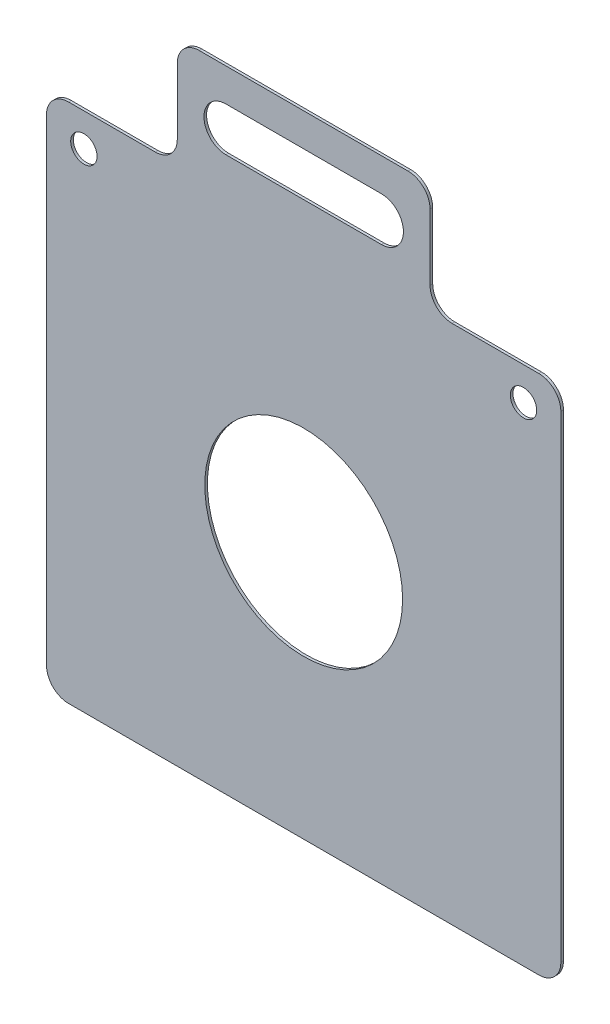
ISO-10303-21;
HEADER;
FILE_DESCRIPTION(('STEP AP214'),'2;1');
FILE_NAME('part.step','',(''),(''),'','','');
FILE_SCHEMA(('AUTOMOTIVE_DESIGN { 1 0 10303 214 1 1 1 1 }'));
ENDSEC;
DATA;
#1=APPLICATION_CONTEXT('core data for automotive mechanical design processes');
#2=APPLICATION_PROTOCOL_DEFINITION('international standard','automotive_design',2000,#1);
#3=PRODUCT_CONTEXT('',#1,'mechanical');
#4=PRODUCT('Part','Part','',(#3));
#5=PRODUCT_RELATED_PRODUCT_CATEGORY('part','',(#4));
#6=PRODUCT_DEFINITION_FORMATION('','',#4);
#7=PRODUCT_DEFINITION_CONTEXT('part definition',#1,'design');
#8=PRODUCT_DEFINITION('design','',#6,#7);
#9=PRODUCT_DEFINITION_SHAPE('','',#8);
#10=(LENGTH_UNIT() NAMED_UNIT(*) SI_UNIT(.MILLI.,.METRE.));
#11=(NAMED_UNIT(*) PLANE_ANGLE_UNIT() SI_UNIT($,.RADIAN.));
#12=(NAMED_UNIT(*) SI_UNIT($,.STERADIAN.) SOLID_ANGLE_UNIT());
#13=UNCERTAINTY_MEASURE_WITH_UNIT(LENGTH_MEASURE(1.E-05),#10,'distance_accuracy_value','');
#14=(GEOMETRIC_REPRESENTATION_CONTEXT(3) GLOBAL_UNCERTAINTY_ASSIGNED_CONTEXT((#13)) GLOBAL_UNIT_ASSIGNED_CONTEXT((#10,
#11,#12)) REPRESENTATION_CONTEXT('',''));
#15=CARTESIAN_POINT('',(0.,0.,0.));
#16=DIRECTION('',(0.,0.,1.));
#17=DIRECTION('',(1.,0.,0.));
#18=AXIS2_PLACEMENT_3D('',#15,#16,#17);
#19=CARTESIAN_POINT('',(-117.,120.,1.2));
#20=DIRECTION('',(0.,-1.,0.));
#21=DIRECTION('',(1.,0.,0.));
#22=AXIS2_PLACEMENT_3D('',#19,#20,#21);
#23=PLANE('',#22);
#24=DIRECTION('',(-1.,0.,0.));
#25=VECTOR('',#24,1.);
#26=CARTESIAN_POINT('',(-117.,120.,1.2));
#27=LINE('',#26,#25);
#28=CARTESIAN_POINT('',(-67.5,120.,1.2));
#29=VERTEX_POINT('',#28);
#30=CARTESIAN_POINT('',(-107.,120.,1.2));
#31=VERTEX_POINT('',#30);
#32=EDGE_CURVE('E248',#29,#31,#27,.T.);
#33=ORIENTED_EDGE('',*,*,#32,.F.);
#34=DIRECTION('',(0.,0.,1.));
#35=VECTOR('',#34,1.);
#36=CARTESIAN_POINT('',(-67.5,120.,1.2));
#37=LINE('',#36,#35);
#38=CARTESIAN_POINT('',(-67.5,120.,0.));
#39=VERTEX_POINT('',#38);
#40=EDGE_CURVE('E307',#29,#39,#37,.F.);
#41=ORIENTED_EDGE('',*,*,#40,.T.);
#42=DIRECTION('',(-1.,0.,0.));
#43=VECTOR('',#42,1.);
#44=CARTESIAN_POINT('',(-117.,120.,0.));
#45=LINE('',#44,#43);
#46=CARTESIAN_POINT('',(-107.,120.,0.));
#47=VERTEX_POINT('',#46);
#48=EDGE_CURVE('E259',#39,#47,#45,.T.);
#49=ORIENTED_EDGE('',*,*,#48,.T.);
#50=DIRECTION('',(0.,0.,-1.));
#51=VECTOR('',#50,1.);
#52=CARTESIAN_POINT('',(-107.,120.,1.2));
#53=LINE('',#52,#51);
#54=EDGE_CURVE('E305',#47,#31,#53,.F.);
#55=ORIENTED_EDGE('',*,*,#54,.T.);
#56=EDGE_LOOP('',(#33,#41,#49,#55));
#57=FACE_BOUND('',#56,.T.);
#58=ADVANCED_FACE('F34',(#57),#23,.F.);
#59=CARTESIAN_POINT('',(0.,0.,1.2));
#60=DIRECTION('',(0.,0.,1.));
#61=DIRECTION('',(1.,0.,0.));
#62=AXIS2_PLACEMENT_3D('',#59,#60,#61);
#63=PLANE('',#62);
#64=CARTESIAN_POINT('',(-100.,105.,1.2));
#65=DIRECTION('',(0.,0.,1.));
#66=DIRECTION('',(1.,0.,0.));
#67=AXIS2_PLACEMENT_3D('',#64,#65,#66);
#68=CIRCLE('',#67,6.);
#69=CARTESIAN_POINT('',(-94.,105.,1.2));
#70=VERTEX_POINT('',#69);
#71=EDGE_CURVE('E226',#70,#70,#68,.T.);
#72=ORIENTED_EDGE('',*,*,#71,.F.);
#73=EDGE_LOOP('',(#72));
#74=FACE_BOUND('',#73,.T.);
#75=DIRECTION('',(0.,1.,0.));
#76=VECTOR('',#75,1.);
#77=CARTESIAN_POINT('',(57.5,170.000000000002,1.2));
#78=LINE('',#77,#76);
#79=CARTESIAN_POINT('',(57.5,130.,1.2));
#80=VERTEX_POINT('',#79);
#81=CARTESIAN_POINT('',(57.5,160.000000000002,1.2));
#82=VERTEX_POINT('',#81);
#83=EDGE_CURVE('E204',#80,#82,#78,.T.);
#84=ORIENTED_EDGE('',*,*,#83,.T.);
#85=CARTESIAN_POINT('',(47.5,160.000000000002,1.20000000000001));
#86=DIRECTION('',(0.,0.,1.));
#87=DIRECTION('',(1.,0.,0.));
#88=AXIS2_PLACEMENT_3D('',#85,#86,#87);
#89=CIRCLE('',#88,10.);
#90=CARTESIAN_POINT('',(47.5,170.000000000002,1.2));
#91=VERTEX_POINT('',#90);
#92=EDGE_CURVE('E283',#82,#91,#89,.T.);
#93=ORIENTED_EDGE('',*,*,#92,.T.);
#94=DIRECTION('',(-1.,0.,0.));
#95=VECTOR('',#94,1.);
#96=CARTESIAN_POINT('',(-57.5,170.000000000002,1.2));
#97=LINE('',#96,#95);
#98=CARTESIAN_POINT('',(-47.5,170.000000000002,1.2));
#99=VERTEX_POINT('',#98);
#100=EDGE_CURVE('E209',#91,#99,#97,.T.);
#101=ORIENTED_EDGE('',*,*,#100,.T.);
#102=CARTESIAN_POINT('',(-47.5,160.000000000002,1.20000000000001));
#103=DIRECTION('',(0.,0.,1.));
#104=DIRECTION('',(1.,0.,0.));
#105=AXIS2_PLACEMENT_3D('',#102,#103,#104);
#106=CIRCLE('',#105,10.);
#107=CARTESIAN_POINT('',(-57.5,160.000000000002,1.2));
#108=VERTEX_POINT('',#107);
#109=EDGE_CURVE('E281',#99,#108,#106,.T.);
#110=ORIENTED_EDGE('',*,*,#109,.T.);
#111=DIRECTION('',(0.,-1.,0.));
#112=VECTOR('',#111,1.);
#113=CARTESIAN_POINT('',(-57.5,120.000000000002,1.2));
#114=LINE('',#113,#112);
#115=CARTESIAN_POINT('',(-57.5,130.,1.2));
#116=VERTEX_POINT('',#115);
#117=EDGE_CURVE('E212',#108,#116,#114,.T.);
#118=ORIENTED_EDGE('',*,*,#117,.T.);
#119=CARTESIAN_POINT('',(-67.5,130.,1.20000000000001));
#120=DIRECTION('',(0.,0.,1.));
#121=DIRECTION('',(1.,0.,0.));
#122=AXIS2_PLACEMENT_3D('',#119,#120,#121);
#123=CIRCLE('',#122,10.);
#124=EDGE_CURVE('E42',#116,#29,#123,.F.);
#125=ORIENTED_EDGE('',*,*,#124,.T.);
#126=ORIENTED_EDGE('',*,*,#32,.T.);
#127=CARTESIAN_POINT('',(-107.,110.,1.2));
#128=DIRECTION('',(0.,0.,1.));
#129=DIRECTION('',(1.,0.,0.));
#130=AXIS2_PLACEMENT_3D('',#127,#128,#129);
#131=CIRCLE('',#130,10.);
#132=CARTESIAN_POINT('',(-117.,110.,1.2));
#133=VERTEX_POINT('',#132);
#134=EDGE_CURVE('E279',#31,#133,#131,.T.);
#135=ORIENTED_EDGE('',*,*,#134,.T.);
#136=DIRECTION('',(0.,-1.,0.));
#137=VECTOR('',#136,1.);
#138=CARTESIAN_POINT('',(-117.,120.,1.2));
#139=LINE('',#138,#137);
#140=CARTESIAN_POINT('',(-117.,-107.,1.2));
#141=VERTEX_POINT('',#140);
#142=EDGE_CURVE('E238',#133,#141,#139,.T.);
#143=ORIENTED_EDGE('',*,*,#142,.T.);
#144=CARTESIAN_POINT('',(-107.,-107.,1.2));
#145=DIRECTION('',(0.,0.,1.));
#146=DIRECTION('',(1.,0.,0.));
#147=AXIS2_PLACEMENT_3D('',#144,#145,#146);
#148=CIRCLE('',#147,10.);
#149=CARTESIAN_POINT('',(-107.,-117.,1.2));
#150=VERTEX_POINT('',#149);
#151=EDGE_CURVE('E275',#141,#150,#148,.T.);
#152=ORIENTED_EDGE('',*,*,#151,.T.);
#153=DIRECTION('',(1.,0.,0.));
#154=VECTOR('',#153,1.);
#155=CARTESIAN_POINT('',(-117.,-117.,1.2));
#156=LINE('',#155,#154);
#157=CARTESIAN_POINT('',(107.,-117.,1.2));
#158=VERTEX_POINT('',#157);
#159=EDGE_CURVE('E241',#150,#158,#156,.T.);
#160=ORIENTED_EDGE('',*,*,#159,.T.);
#161=CARTESIAN_POINT('',(107.,-107.,1.2));
#162=DIRECTION('',(0.,0.,1.));
#163=DIRECTION('',(1.,0.,0.));
#164=AXIS2_PLACEMENT_3D('',#161,#162,#163);
#165=CIRCLE('',#164,10.);
#166=CARTESIAN_POINT('',(117.,-107.,1.2));
#167=VERTEX_POINT('',#166);
#168=EDGE_CURVE('E277',#158,#167,#165,.T.);
#169=ORIENTED_EDGE('',*,*,#168,.T.);
#170=DIRECTION('',(0.,1.,0.));
#171=VECTOR('',#170,1.);
#172=CARTESIAN_POINT('',(117.,120.,1.2));
#173=LINE('',#172,#171);
#174=CARTESIAN_POINT('',(117.,110.,1.2));
#175=VERTEX_POINT('',#174);
#176=EDGE_CURVE('E245',#167,#175,#173,.T.);
#177=ORIENTED_EDGE('',*,*,#176,.T.);
#178=CARTESIAN_POINT('',(107.,110.,1.2));
#179=DIRECTION('',(0.,0.,1.));
#180=DIRECTION('',(1.,0.,0.));
#181=AXIS2_PLACEMENT_3D('',#178,#179,#180);
#182=CIRCLE('',#181,10.);
#183=CARTESIAN_POINT('',(107.,120.,1.2));
#184=VERTEX_POINT('',#183);
#185=EDGE_CURVE('E273',#175,#184,#182,.T.);
#186=ORIENTED_EDGE('',*,*,#185,.T.);
#187=CARTESIAN_POINT('',(67.4999999999999,120.,1.2));
#188=VERTEX_POINT('',#187);
#189=EDGE_CURVE('E251',#184,#188,#27,.T.);
#190=ORIENTED_EDGE('',*,*,#189,.T.);
#191=CARTESIAN_POINT('',(67.5,130.,1.2));
#192=DIRECTION('',(0.,0.,1.));
#193=DIRECTION('',(1.,0.,0.));
#194=AXIS2_PLACEMENT_3D('',#191,#192,#193);
#195=CIRCLE('',#194,10.);
#196=EDGE_CURVE('E323',#188,#80,#195,.F.);
#197=ORIENTED_EDGE('',*,*,#196,.T.);
#198=EDGE_LOOP('',(#84,#93,#101,#110,#118,#125,#126,#135,#143,#152,#160,#169,#177,#186,#190,#197));
#199=FACE_BOUND('',#198,.T.);
#200=CARTESIAN_POINT('',(0.,0.,1.2));
#201=DIRECTION('',(0.,0.,1.));
#202=DIRECTION('',(1.,0.,0.));
#203=AXIS2_PLACEMENT_3D('',#200,#201,#202);
#204=CIRCLE('',#203,45.);
#205=CARTESIAN_POINT('',(45.,0.,1.2));
#206=VERTEX_POINT('',#205);
#207=EDGE_CURVE('E232',#206,#206,#204,.T.);
#208=ORIENTED_EDGE('',*,*,#207,.F.);
#209=EDGE_LOOP('',(#208));
#210=FACE_BOUND('',#209,.T.);
#211=CARTESIAN_POINT('',(100.,105.,1.2));
#212=DIRECTION('',(0.,0.,1.));
#213=DIRECTION('',(-1.,0.,0.));
#214=AXIS2_PLACEMENT_3D('',#211,#212,#213);
#215=CIRCLE('',#214,6.);
#216=CARTESIAN_POINT('',(94.,105.,1.2));
#217=VERTEX_POINT('',#216);
#218=EDGE_CURVE('E218',#217,#217,#215,.T.);
#219=ORIENTED_EDGE('',*,*,#218,.F.);
#220=EDGE_LOOP('',(#219));
#221=FACE_BOUND('',#220,.T.);
#222=DIRECTION('',(1.,0.,0.));
#223=VECTOR('',#222,1.);
#224=CARTESIAN_POINT('',(-35.37060023,134.999999999999,1.2));
#225=LINE('',#224,#223);
#226=CARTESIAN_POINT('',(-35.37060023,134.999999999999,1.2));
#227=VERTEX_POINT('',#226);
#228=CARTESIAN_POINT('',(35.37060023,135.,1.2));
#229=VERTEX_POINT('',#228);
#230=EDGE_CURVE('E187',#227,#229,#225,.T.);
#231=ORIENTED_EDGE('',*,*,#230,.F.);
#232=CARTESIAN_POINT('',(-35.37060023,145.000000000002,1.2));
#233=DIRECTION('',(0.,0.,1.));
#234=DIRECTION('',(1.,0.,0.));
#235=AXIS2_PLACEMENT_3D('',#232,#233,#234);
#236=CIRCLE('',#235,10.0000000000015);
#237=CARTESIAN_POINT('',(-35.37060023,155.000000000002,1.2));
#238=VERTEX_POINT('',#237);
#239=EDGE_CURVE('E193',#238,#227,#236,.T.);
#240=ORIENTED_EDGE('',*,*,#239,.F.);
#241=DIRECTION('',(-1.,0.,0.));
#242=VECTOR('',#241,1.);
#243=CARTESIAN_POINT('',(-35.37060023,155.000000000002,1.2));
#244=LINE('',#243,#242);
#245=CARTESIAN_POINT('',(35.37060023,155.000000000002,1.2));
#246=VERTEX_POINT('',#245);
#247=EDGE_CURVE('E197',#246,#238,#244,.T.);
#248=ORIENTED_EDGE('',*,*,#247,.F.);
#249=CARTESIAN_POINT('',(35.37060023,145.000000000002,1.2));
#250=DIRECTION('',(0.,0.,1.));
#251=DIRECTION('',(1.,0.,0.));
#252=AXIS2_PLACEMENT_3D('',#249,#250,#251);
#253=CIRCLE('',#252,10.0000000000015);
#254=EDGE_CURVE('E178',#229,#246,#253,.T.);
#255=ORIENTED_EDGE('',*,*,#254,.F.);
#256=EDGE_LOOP('',(#231,#240,#248,#255));
#257=FACE_BOUND('',#256,.T.);
#258=ADVANCED_FACE('F195',(#74,#199,#210,#221,#257),#63,.T.);
#259=CARTESIAN_POINT('',(0.,0.,0.));
#260=DIRECTION('',(0.,0.,1.));
#261=DIRECTION('',(1.,0.,0.));
#262=AXIS2_PLACEMENT_3D('',#259,#260,#261);
#263=PLANE('',#262);
#264=DIRECTION('',(1.,0.,0.));
#265=VECTOR('',#264,1.);
#266=CARTESIAN_POINT('',(-57.5,170.000000000002,0.));
#267=LINE('',#266,#265);
#268=CARTESIAN_POINT('',(-47.5,170.000000000002,0.));
#269=VERTEX_POINT('',#268);
#270=CARTESIAN_POINT('',(47.5,170.000000000002,0.));
#271=VERTEX_POINT('',#270);
#272=EDGE_CURVE('E217',#269,#271,#267,.T.);
#273=ORIENTED_EDGE('',*,*,#272,.T.);
#274=CARTESIAN_POINT('',(47.5,160.000000000002,0.));
#275=DIRECTION('',(0.,0.,1.));
#276=DIRECTION('',(1.,0.,0.));
#277=AXIS2_PLACEMENT_3D('',#274,#275,#276);
#278=CIRCLE('',#277,10.);
#279=CARTESIAN_POINT('',(57.5,160.000000000002,0.));
#280=VERTEX_POINT('',#279);
#281=EDGE_CURVE('E298',#271,#280,#278,.F.);
#282=ORIENTED_EDGE('',*,*,#281,.T.);
#283=DIRECTION('',(0.,-1.,0.));
#284=VECTOR('',#283,1.);
#285=CARTESIAN_POINT('',(57.5,170.000000000002,0.));
#286=LINE('',#285,#284);
#287=CARTESIAN_POINT('',(57.5,130.,0.));
#288=VERTEX_POINT('',#287);
#289=EDGE_CURVE('E225',#280,#288,#286,.T.);
#290=ORIENTED_EDGE('',*,*,#289,.T.);
#291=CARTESIAN_POINT('',(67.5,130.,0.));
#292=DIRECTION('',(0.,0.,1.));
#293=DIRECTION('',(1.,0.,0.));
#294=AXIS2_PLACEMENT_3D('',#291,#292,#293);
#295=CIRCLE('',#294,10.);
#296=CARTESIAN_POINT('',(67.4999999999999,120.,0.));
#297=VERTEX_POINT('',#296);
#298=EDGE_CURVE('E325',#288,#297,#295,.T.);
#299=ORIENTED_EDGE('',*,*,#298,.T.);
#300=CARTESIAN_POINT('',(107.,120.,0.));
#301=VERTEX_POINT('',#300);
#302=EDGE_CURVE('E242',#301,#297,#45,.T.);
#303=ORIENTED_EDGE('',*,*,#302,.F.);
#304=CARTESIAN_POINT('',(107.,110.,0.));
#305=DIRECTION('',(0.,0.,1.));
#306=DIRECTION('',(1.,0.,0.));
#307=AXIS2_PLACEMENT_3D('',#304,#305,#306);
#308=CIRCLE('',#307,10.);
#309=CARTESIAN_POINT('',(117.,110.,0.));
#310=VERTEX_POINT('',#309);
#311=EDGE_CURVE('E290',#301,#310,#308,.F.);
#312=ORIENTED_EDGE('',*,*,#311,.T.);
#313=DIRECTION('',(0.,1.,0.));
#314=VECTOR('',#313,1.);
#315=CARTESIAN_POINT('',(117.,120.,0.));
#316=LINE('',#315,#314);
#317=CARTESIAN_POINT('',(117.,-107.,0.));
#318=VERTEX_POINT('',#317);
#319=EDGE_CURVE('E256',#318,#310,#316,.T.);
#320=ORIENTED_EDGE('',*,*,#319,.F.);
#321=CARTESIAN_POINT('',(107.,-107.,0.));
#322=DIRECTION('',(0.,0.,1.));
#323=DIRECTION('',(1.,0.,0.));
#324=AXIS2_PLACEMENT_3D('',#321,#322,#323);
#325=CIRCLE('',#324,10.);
#326=CARTESIAN_POINT('',(107.,-117.,0.));
#327=VERTEX_POINT('',#326);
#328=EDGE_CURVE('E49',#318,#327,#325,.F.);
#329=ORIENTED_EDGE('',*,*,#328,.T.);
#330=DIRECTION('',(1.,0.,0.));
#331=VECTOR('',#330,1.);
#332=CARTESIAN_POINT('',(-117.,-117.,0.));
#333=LINE('',#332,#331);
#334=CARTESIAN_POINT('',(-107.,-117.,0.));
#335=VERTEX_POINT('',#334);
#336=EDGE_CURVE('E254',#335,#327,#333,.T.);
#337=ORIENTED_EDGE('',*,*,#336,.F.);
#338=CARTESIAN_POINT('',(-107.,-107.,0.));
#339=DIRECTION('',(0.,0.,1.));
#340=DIRECTION('',(1.,0.,0.));
#341=AXIS2_PLACEMENT_3D('',#338,#339,#340);
#342=CIRCLE('',#341,10.);
#343=CARTESIAN_POINT('',(-117.,-107.,0.));
#344=VERTEX_POINT('',#343);
#345=EDGE_CURVE('E57',#335,#344,#342,.F.);
#346=ORIENTED_EDGE('',*,*,#345,.T.);
#347=DIRECTION('',(0.,-1.,0.));
#348=VECTOR('',#347,1.);
#349=CARTESIAN_POINT('',(-117.,120.,0.));
#350=LINE('',#349,#348);
#351=CARTESIAN_POINT('',(-117.,110.,0.));
#352=VERTEX_POINT('',#351);
#353=EDGE_CURVE('E235',#352,#344,#350,.T.);
#354=ORIENTED_EDGE('',*,*,#353,.F.);
#355=CARTESIAN_POINT('',(-107.,110.,0.));
#356=DIRECTION('',(0.,0.,1.));
#357=DIRECTION('',(1.,0.,0.));
#358=AXIS2_PLACEMENT_3D('',#355,#356,#357);
#359=CIRCLE('',#358,10.);
#360=EDGE_CURVE('E294',#352,#47,#359,.F.);
#361=ORIENTED_EDGE('',*,*,#360,.T.);
#362=ORIENTED_EDGE('',*,*,#48,.F.);
#363=CARTESIAN_POINT('',(-67.5,130.,0.));
#364=DIRECTION('',(0.,0.,1.));
#365=DIRECTION('',(1.,0.,0.));
#366=AXIS2_PLACEMENT_3D('',#363,#364,#365);
#367=CIRCLE('',#366,10.);
#368=CARTESIAN_POINT('',(-57.5,130.,0.));
#369=VERTEX_POINT('',#368);
#370=EDGE_CURVE('E11',#39,#369,#367,.T.);
#371=ORIENTED_EDGE('',*,*,#370,.T.);
#372=DIRECTION('',(0.,1.,0.));
#373=VECTOR('',#372,1.);
#374=CARTESIAN_POINT('',(-57.5,120.000000000002,0.));
#375=LINE('',#374,#373);
#376=CARTESIAN_POINT('',(-57.5,160.000000000002,0.));
#377=VERTEX_POINT('',#376);
#378=EDGE_CURVE('E344',#369,#377,#375,.T.);
#379=ORIENTED_EDGE('',*,*,#378,.T.);
#380=CARTESIAN_POINT('',(-47.5,160.000000000002,0.));
#381=DIRECTION('',(0.,0.,1.));
#382=DIRECTION('',(1.,0.,0.));
#383=AXIS2_PLACEMENT_3D('',#380,#381,#382);
#384=CIRCLE('',#383,10.);
#385=EDGE_CURVE('E296',#377,#269,#384,.F.);
#386=ORIENTED_EDGE('',*,*,#385,.T.);
#387=EDGE_LOOP('',(#273,#282,#290,#299,#303,#312,#320,#329,#337,#346,#354,#361,#362,#371,#379,#386));
#388=FACE_BOUND('',#387,.T.);
#389=CARTESIAN_POINT('',(0.,0.,0.));
#390=DIRECTION('',(0.,0.,1.));
#391=DIRECTION('',(1.,0.,0.));
#392=AXIS2_PLACEMENT_3D('',#389,#390,#391);
#393=CIRCLE('',#392,45.);
#394=CARTESIAN_POINT('',(45.,0.,0.));
#395=VERTEX_POINT('',#394);
#396=EDGE_CURVE('E229',#395,#395,#393,.T.);
#397=ORIENTED_EDGE('',*,*,#396,.T.);
#398=EDGE_LOOP('',(#397));
#399=FACE_BOUND('',#398,.T.);
#400=CARTESIAN_POINT('',(-100.,105.,0.));
#401=DIRECTION('',(0.,0.,1.));
#402=DIRECTION('',(1.,0.,0.));
#403=AXIS2_PLACEMENT_3D('',#400,#401,#402);
#404=CIRCLE('',#403,6.);
#405=CARTESIAN_POINT('',(-94.,105.,0.));
#406=VERTEX_POINT('',#405);
#407=EDGE_CURVE('E221',#406,#406,#404,.T.);
#408=ORIENTED_EDGE('',*,*,#407,.T.);
#409=EDGE_LOOP('',(#408));
#410=FACE_BOUND('',#409,.T.);
#411=CARTESIAN_POINT('',(100.,105.,0.));
#412=DIRECTION('',(0.,0.,1.));
#413=DIRECTION('',(-1.,0.,0.));
#414=AXIS2_PLACEMENT_3D('',#411,#412,#413);
#415=CIRCLE('',#414,6.);
#416=CARTESIAN_POINT('',(94.,105.,0.));
#417=VERTEX_POINT('',#416);
#418=EDGE_CURVE('E222',#417,#417,#415,.T.);
#419=ORIENTED_EDGE('',*,*,#418,.T.);
#420=EDGE_LOOP('',(#419));
#421=FACE_BOUND('',#420,.T.);
#422=DIRECTION('',(-1.,0.,0.));
#423=VECTOR('',#422,1.);
#424=CARTESIAN_POINT('',(-35.37060023,134.999999999999,0.));
#425=LINE('',#424,#423);
#426=CARTESIAN_POINT('',(35.37060023,134.999999999999,0.));
#427=VERTEX_POINT('',#426);
#428=CARTESIAN_POINT('',(-35.37060023,134.999999999999,0.));
#429=VERTEX_POINT('',#428);
#430=EDGE_CURVE('E215',#427,#429,#425,.T.);
#431=ORIENTED_EDGE('',*,*,#430,.F.);
#432=CARTESIAN_POINT('',(35.37060023,145.000000000002,0.));
#433=DIRECTION('',(0.,0.,1.));
#434=DIRECTION('',(1.,0.,0.));
#435=AXIS2_PLACEMENT_3D('',#432,#433,#434);
#436=CIRCLE('',#435,10.0000000000015);
#437=CARTESIAN_POINT('',(35.37060023,155.000000000003,0.));
#438=VERTEX_POINT('',#437);
#439=EDGE_CURVE('E180',#438,#427,#436,.F.);
#440=ORIENTED_EDGE('',*,*,#439,.F.);
#441=DIRECTION('',(1.,0.,0.));
#442=VECTOR('',#441,1.);
#443=CARTESIAN_POINT('',(-35.37060023,155.000000000002,0.));
#444=LINE('',#443,#442);
#445=CARTESIAN_POINT('',(-35.37060023,155.000000000002,0.));
#446=VERTEX_POINT('',#445);
#447=EDGE_CURVE('E352',#446,#438,#444,.T.);
#448=ORIENTED_EDGE('',*,*,#447,.F.);
#449=CARTESIAN_POINT('',(-35.37060023,145.000000000002,0.));
#450=DIRECTION('',(0.,0.,1.));
#451=DIRECTION('',(1.,0.,0.));
#452=AXIS2_PLACEMENT_3D('',#449,#450,#451);
#453=CIRCLE('',#452,10.0000000000015);
#454=EDGE_CURVE('E349',#429,#446,#453,.F.);
#455=ORIENTED_EDGE('',*,*,#454,.F.);
#456=EDGE_LOOP('',(#431,#440,#448,#455));
#457=FACE_BOUND('',#456,.T.);
#458=ADVANCED_FACE('F342',(#388,#399,#410,#421,#457),#263,.F.);
#459=CARTESIAN_POINT('',(-117.,120.,1.2));
#460=DIRECTION('',(1.,0.,0.));
#461=DIRECTION('',(0.,1.,0.));
#462=AXIS2_PLACEMENT_3D('',#459,#460,#461);
#463=PLANE('',#462);
#464=ORIENTED_EDGE('',*,*,#142,.F.);
#465=DIRECTION('',(0.,0.,-1.));
#466=VECTOR('',#465,1.);
#467=CARTESIAN_POINT('',(-117.,110.,1.2));
#468=LINE('',#467,#466);
#469=EDGE_CURVE('E311',#133,#352,#468,.T.);
#470=ORIENTED_EDGE('',*,*,#469,.T.);
#471=ORIENTED_EDGE('',*,*,#353,.T.);
#472=DIRECTION('',(0.,0.,-1.));
#473=VECTOR('',#472,1.);
#474=CARTESIAN_POINT('',(-117.,-107.,1.2));
#475=LINE('',#474,#473);
#476=EDGE_CURVE('E309',#344,#141,#475,.F.);
#477=ORIENTED_EDGE('',*,*,#476,.T.);
#478=EDGE_LOOP('',(#464,#470,#471,#477));
#479=FACE_BOUND('',#478,.T.);
#480=ADVANCED_FACE('F402',(#479),#463,.F.);
#481=CARTESIAN_POINT('',(-117.,-117.,1.2));
#482=DIRECTION('',(0.,1.,0.));
#483=DIRECTION('',(-1.,0.,0.));
#484=AXIS2_PLACEMENT_3D('',#481,#482,#483);
#485=PLANE('',#484);
#486=ORIENTED_EDGE('',*,*,#336,.T.);
#487=DIRECTION('',(0.,0.,-1.));
#488=VECTOR('',#487,1.);
#489=CARTESIAN_POINT('',(107.,-117.,1.2));
#490=LINE('',#489,#488);
#491=EDGE_CURVE('E321',#327,#158,#490,.F.);
#492=ORIENTED_EDGE('',*,*,#491,.T.);
#493=ORIENTED_EDGE('',*,*,#159,.F.);
#494=DIRECTION('',(0.,0.,-1.));
#495=VECTOR('',#494,1.);
#496=CARTESIAN_POINT('',(-107.,-117.,1.2));
#497=LINE('',#496,#495);
#498=EDGE_CURVE('E319',#150,#335,#497,.T.);
#499=ORIENTED_EDGE('',*,*,#498,.T.);
#500=EDGE_LOOP('',(#486,#492,#493,#499));
#501=FACE_BOUND('',#500,.T.);
#502=ADVANCED_FACE('F396',(#501),#485,.F.);
#503=CARTESIAN_POINT('',(117.,120.,1.2));
#504=DIRECTION('',(-1.,0.,0.));
#505=DIRECTION('',(0.,-1.,0.));
#506=AXIS2_PLACEMENT_3D('',#503,#504,#505);
#507=PLANE('',#506);
#508=ORIENTED_EDGE('',*,*,#176,.F.);
#509=DIRECTION('',(0.,0.,-1.));
#510=VECTOR('',#509,1.);
#511=CARTESIAN_POINT('',(117.,-107.,1.2));
#512=LINE('',#511,#510);
#513=EDGE_CURVE('E316',#167,#318,#512,.T.);
#514=ORIENTED_EDGE('',*,*,#513,.T.);
#515=ORIENTED_EDGE('',*,*,#319,.T.);
#516=DIRECTION('',(0.,0.,-1.));
#517=VECTOR('',#516,1.);
#518=CARTESIAN_POINT('',(117.,110.,1.2));
#519=LINE('',#518,#517);
#520=EDGE_CURVE('E314',#310,#175,#519,.F.);
#521=ORIENTED_EDGE('',*,*,#520,.T.);
#522=EDGE_LOOP('',(#508,#514,#515,#521));
#523=FACE_BOUND('',#522,.T.);
#524=ADVANCED_FACE('F388',(#523),#507,.F.);
#525=ORIENTED_EDGE('',*,*,#302,.T.);
#526=DIRECTION('',(0.,0.,1.));
#527=VECTOR('',#526,1.);
#528=CARTESIAN_POINT('',(67.5,120.,1.2));
#529=LINE('',#528,#527);
#530=EDGE_CURVE('E265',#297,#188,#529,.T.);
#531=ORIENTED_EDGE('',*,*,#530,.T.);
#532=ORIENTED_EDGE('',*,*,#189,.F.);
#533=DIRECTION('',(0.,0.,-1.));
#534=VECTOR('',#533,1.);
#535=CARTESIAN_POINT('',(107.,120.,1.2));
#536=LINE('',#535,#534);
#537=EDGE_CURVE('E262',#184,#301,#536,.T.);
#538=ORIENTED_EDGE('',*,*,#537,.T.);
#539=EDGE_LOOP('',(#525,#531,#532,#538));
#540=FACE_BOUND('',#539,.T.);
#541=ADVANCED_FACE('F380',(#540),#23,.F.);
#542=CARTESIAN_POINT('',(0.,0.,1.2));
#543=DIRECTION('',(0.,0.,-1.));
#544=DIRECTION('',(-1.,0.,0.));
#545=AXIS2_PLACEMENT_3D('',#542,#543,#544);
#546=CYLINDRICAL_SURFACE('',#545,45.);
#547=ORIENTED_EDGE('',*,*,#207,.T.);
#548=EDGE_LOOP('',(#547));
#549=FACE_BOUND('',#548,.T.);
#550=ORIENTED_EDGE('',*,*,#396,.F.);
#551=EDGE_LOOP('',(#550));
#552=FACE_BOUND('',#551,.T.);
#553=ADVANCED_FACE('F425',(#549,#552),#546,.F.);
#554=CARTESIAN_POINT('',(-100.,105.,1.2));
#555=DIRECTION('',(0.,0.,-1.));
#556=DIRECTION('',(-1.,0.,0.));
#557=AXIS2_PLACEMENT_3D('',#554,#555,#556);
#558=CYLINDRICAL_SURFACE('',#557,6.);
#559=ORIENTED_EDGE('',*,*,#71,.T.);
#560=EDGE_LOOP('',(#559));
#561=FACE_BOUND('',#560,.T.);
#562=ORIENTED_EDGE('',*,*,#407,.F.);
#563=EDGE_LOOP('',(#562));
#564=FACE_BOUND('',#563,.T.);
#565=ADVANCED_FACE('F430',(#561,#564),#558,.F.);
#566=CARTESIAN_POINT('',(100.,105.,1.2));
#567=DIRECTION('',(0.,0.,-1.));
#568=DIRECTION('',(-1.,0.,0.));
#569=AXIS2_PLACEMENT_3D('',#566,#567,#568);
#570=CYLINDRICAL_SURFACE('',#569,6.);
#571=ORIENTED_EDGE('',*,*,#218,.T.);
#572=EDGE_LOOP('',(#571));
#573=FACE_BOUND('',#572,.T.);
#574=ORIENTED_EDGE('',*,*,#418,.F.);
#575=EDGE_LOOP('',(#574));
#576=FACE_BOUND('',#575,.T.);
#577=ADVANCED_FACE('F458',(#573,#576),#570,.F.);
#578=CARTESIAN_POINT('',(57.5,170.000000000002,-125.399362039845));
#579=DIRECTION('',(1.,0.,0.));
#580=DIRECTION('',(0.,1.,0.));
#581=AXIS2_PLACEMENT_3D('',#578,#579,#580);
#582=PLANE('',#581);
#583=ORIENTED_EDGE('',*,*,#83,.F.);
#584=DIRECTION('',(0.,0.,1.));
#585=VECTOR('',#584,1.);
#586=CARTESIAN_POINT('',(57.5,130.,-125.399362039845));
#587=LINE('',#586,#585);
#588=EDGE_CURVE('E271',#80,#288,#587,.F.);
#589=ORIENTED_EDGE('',*,*,#588,.T.);
#590=ORIENTED_EDGE('',*,*,#289,.F.);
#591=DIRECTION('',(0.,0.,1.));
#592=VECTOR('',#591,1.);
#593=CARTESIAN_POINT('',(57.5,160.000000000002,-125.399362039845));
#594=LINE('',#593,#592);
#595=EDGE_CURVE('E268',#280,#82,#594,.T.);
#596=ORIENTED_EDGE('',*,*,#595,.T.);
#597=EDGE_LOOP('',(#583,#589,#590,#596));
#598=FACE_BOUND('',#597,.T.);
#599=ADVANCED_FACE('F456',(#598),#582,.T.);
#600=CARTESIAN_POINT('',(-57.5,170.000000000002,-125.399362039845));
#601=DIRECTION('',(0.,1.,0.));
#602=DIRECTION('',(0.,0.,1.));
#603=AXIS2_PLACEMENT_3D('',#600,#601,#602);
#604=PLANE('',#603);
#605=ORIENTED_EDGE('',*,*,#100,.F.);
#606=DIRECTION('',(0.,0.,1.));
#607=VECTOR('',#606,1.);
#608=CARTESIAN_POINT('',(47.5,170.000000000002,-125.399362039845));
#609=LINE('',#608,#607);
#610=EDGE_CURVE('E288',#91,#271,#609,.F.);
#611=ORIENTED_EDGE('',*,*,#610,.T.);
#612=ORIENTED_EDGE('',*,*,#272,.F.);
#613=DIRECTION('',(0.,0.,1.));
#614=VECTOR('',#613,1.);
#615=CARTESIAN_POINT('',(-47.5,170.000000000002,-125.399362039845));
#616=LINE('',#615,#614);
#617=EDGE_CURVE('E285',#269,#99,#616,.T.);
#618=ORIENTED_EDGE('',*,*,#617,.T.);
#619=EDGE_LOOP('',(#605,#611,#612,#618));
#620=FACE_BOUND('',#619,.T.);
#621=ADVANCED_FACE('F454',(#620),#604,.T.);
#622=CARTESIAN_POINT('',(-57.5,120.000000000002,-125.399362039845));
#623=DIRECTION('',(-1.,0.,0.));
#624=DIRECTION('',(0.,0.,1.));
#625=AXIS2_PLACEMENT_3D('',#622,#623,#624);
#626=PLANE('',#625);
#627=ORIENTED_EDGE('',*,*,#117,.F.);
#628=DIRECTION('',(0.,0.,1.));
#629=VECTOR('',#628,1.);
#630=CARTESIAN_POINT('',(-57.5,160.000000000002,-125.399362039845));
#631=LINE('',#630,#629);
#632=EDGE_CURVE('E303',#108,#377,#631,.F.);
#633=ORIENTED_EDGE('',*,*,#632,.T.);
#634=ORIENTED_EDGE('',*,*,#378,.F.);
#635=DIRECTION('',(0.,0.,1.));
#636=VECTOR('',#635,1.);
#637=CARTESIAN_POINT('',(-57.5,130.,-125.399362039845));
#638=LINE('',#637,#636);
#639=EDGE_CURVE('E300',#369,#116,#638,.T.);
#640=ORIENTED_EDGE('',*,*,#639,.T.);
#641=EDGE_LOOP('',(#627,#633,#634,#640));
#642=FACE_BOUND('',#641,.T.);
#643=ADVANCED_FACE('F347',(#642),#626,.T.);
#644=CARTESIAN_POINT('',(-35.37060023,134.999999999999,-125.399362039845));
#645=DIRECTION('',(0.,-1.,0.));
#646=DIRECTION('',(0.,0.,-1.));
#647=AXIS2_PLACEMENT_3D('',#644,#645,#646);
#648=PLANE('',#647);
#649=DIRECTION('',(0.,0.,1.));
#650=VECTOR('',#649,1.);
#651=CARTESIAN_POINT('',(35.37060023,135.,-125.399362039845));
#652=LINE('',#651,#650);
#653=EDGE_CURVE('E173',#427,#229,#652,.T.);
#654=ORIENTED_EDGE('',*,*,#653,.F.);
#655=ORIENTED_EDGE('',*,*,#430,.T.);
#656=DIRECTION('',(0.,0.,1.));
#657=VECTOR('',#656,1.);
#658=CARTESIAN_POINT('',(-35.37060023,134.999999999999,-125.399362039845));
#659=LINE('',#658,#657);
#660=EDGE_CURVE('E184',#429,#227,#659,.T.);
#661=ORIENTED_EDGE('',*,*,#660,.T.);
#662=ORIENTED_EDGE('',*,*,#230,.T.);
#663=EDGE_LOOP('',(#654,#655,#661,#662));
#664=FACE_BOUND('',#663,.T.);
#665=ADVANCED_FACE('F188',(#664),#648,.F.);
#666=CARTESIAN_POINT('',(35.37060023,145.000000000002,-125.399362039845));
#667=DIRECTION('',(0.,0.,1.));
#668=DIRECTION('',(1.,0.,0.));
#669=AXIS2_PLACEMENT_3D('',#666,#667,#668);
#670=CYLINDRICAL_SURFACE('',#669,10.0000000000015);
#671=DIRECTION('',(0.,0.,1.));
#672=VECTOR('',#671,1.);
#673=CARTESIAN_POINT('',(35.37060023,155.000000000002,-125.399362039845));
#674=LINE('',#673,#672);
#675=EDGE_CURVE('E183',#438,#246,#674,.T.);
#676=ORIENTED_EDGE('',*,*,#675,.F.);
#677=ORIENTED_EDGE('',*,*,#439,.T.);
#678=ORIENTED_EDGE('',*,*,#653,.T.);
#679=ORIENTED_EDGE('',*,*,#254,.T.);
#680=EDGE_LOOP('',(#676,#677,#678,#679));
#681=FACE_BOUND('',#680,.T.);
#682=ADVANCED_FACE('F176',(#681),#670,.F.);
#683=CARTESIAN_POINT('',(-35.37060023,155.000000000002,-125.399362039845));
#684=DIRECTION('',(0.,1.,0.));
#685=DIRECTION('',(0.,0.,1.));
#686=AXIS2_PLACEMENT_3D('',#683,#684,#685);
#687=PLANE('',#686);
#688=DIRECTION('',(0.,0.,1.));
#689=VECTOR('',#688,1.);
#690=CARTESIAN_POINT('',(-35.37060023,155.000000000002,-125.399362039845));
#691=LINE('',#690,#689);
#692=EDGE_CURVE('E202',#446,#238,#691,.T.);
#693=ORIENTED_EDGE('',*,*,#692,.F.);
#694=ORIENTED_EDGE('',*,*,#447,.T.);
#695=ORIENTED_EDGE('',*,*,#675,.T.);
#696=ORIENTED_EDGE('',*,*,#247,.T.);
#697=EDGE_LOOP('',(#693,#694,#695,#696));
#698=FACE_BOUND('',#697,.T.);
#699=ADVANCED_FACE('F361',(#698),#687,.F.);
#700=CARTESIAN_POINT('',(-35.37060023,145.000000000002,-125.399362039845));
#701=DIRECTION('',(0.,0.,1.));
#702=DIRECTION('',(1.,0.,0.));
#703=AXIS2_PLACEMENT_3D('',#700,#701,#702);
#704=CYLINDRICAL_SURFACE('',#703,10.0000000000015);
#705=ORIENTED_EDGE('',*,*,#660,.F.);
#706=ORIENTED_EDGE('',*,*,#454,.T.);
#707=ORIENTED_EDGE('',*,*,#692,.T.);
#708=ORIENTED_EDGE('',*,*,#239,.T.);
#709=EDGE_LOOP('',(#705,#706,#707,#708));
#710=FACE_BOUND('',#709,.T.);
#711=ADVANCED_FACE('F357',(#710),#704,.F.);
#712=CARTESIAN_POINT('',(67.5,130.,1.2));
#713=DIRECTION('',(0.,0.,1.));
#714=DIRECTION('',(1.,0.,0.));
#715=AXIS2_PLACEMENT_3D('',#712,#713,#714);
#716=CYLINDRICAL_SURFACE('',#715,10.);
#717=ORIENTED_EDGE('',*,*,#298,.F.);
#718=ORIENTED_EDGE('',*,*,#588,.F.);
#719=ORIENTED_EDGE('',*,*,#196,.F.);
#720=ORIENTED_EDGE('',*,*,#530,.F.);
#721=EDGE_LOOP('',(#717,#718,#719,#720));
#722=FACE_BOUND('',#721,.T.);
#723=ADVANCED_FACE('F376',(#722),#716,.F.);
#724=CARTESIAN_POINT('',(47.5,160.000000000002,-125.399362039845));
#725=DIRECTION('',(0.,0.,1.));
#726=DIRECTION('',(1.,0.,0.));
#727=AXIS2_PLACEMENT_3D('',#724,#725,#726);
#728=CYLINDRICAL_SURFACE('',#727,10.);
#729=ORIENTED_EDGE('',*,*,#281,.F.);
#730=ORIENTED_EDGE('',*,*,#610,.F.);
#731=ORIENTED_EDGE('',*,*,#92,.F.);
#732=ORIENTED_EDGE('',*,*,#595,.F.);
#733=EDGE_LOOP('',(#729,#730,#731,#732));
#734=FACE_BOUND('',#733,.T.);
#735=ADVANCED_FACE('F442',(#734),#728,.T.);
#736=CARTESIAN_POINT('',(-47.5,160.000000000002,-125.399362039845));
#737=DIRECTION('',(0.,0.,1.));
#738=DIRECTION('',(1.,0.,0.));
#739=AXIS2_PLACEMENT_3D('',#736,#737,#738);
#740=CYLINDRICAL_SURFACE('',#739,10.);
#741=ORIENTED_EDGE('',*,*,#385,.F.);
#742=ORIENTED_EDGE('',*,*,#632,.F.);
#743=ORIENTED_EDGE('',*,*,#109,.F.);
#744=ORIENTED_EDGE('',*,*,#617,.F.);
#745=EDGE_LOOP('',(#741,#742,#743,#744));
#746=FACE_BOUND('',#745,.T.);
#747=ADVANCED_FACE('F413',(#746),#740,.T.);
#748=CARTESIAN_POINT('',(-67.5,130.,-125.399362039845));
#749=DIRECTION('',(0.,0.,1.));
#750=DIRECTION('',(1.,0.,0.));
#751=AXIS2_PLACEMENT_3D('',#748,#749,#750);
#752=CYLINDRICAL_SURFACE('',#751,10.);
#753=ORIENTED_EDGE('',*,*,#370,.F.);
#754=ORIENTED_EDGE('',*,*,#40,.F.);
#755=ORIENTED_EDGE('',*,*,#124,.F.);
#756=ORIENTED_EDGE('',*,*,#639,.F.);
#757=EDGE_LOOP('',(#753,#754,#755,#756));
#758=FACE_BOUND('',#757,.T.);
#759=ADVANCED_FACE('F338',(#758),#752,.F.);
#760=CARTESIAN_POINT('',(-107.,110.,1.2));
#761=DIRECTION('',(0.,0.,-1.));
#762=DIRECTION('',(-1.,0.,0.));
#763=AXIS2_PLACEMENT_3D('',#760,#761,#762);
#764=CYLINDRICAL_SURFACE('',#763,10.);
#765=ORIENTED_EDGE('',*,*,#134,.F.);
#766=ORIENTED_EDGE('',*,*,#54,.F.);
#767=ORIENTED_EDGE('',*,*,#360,.F.);
#768=ORIENTED_EDGE('',*,*,#469,.F.);
#769=EDGE_LOOP('',(#765,#766,#767,#768));
#770=FACE_BOUND('',#769,.T.);
#771=ADVANCED_FACE('F405',(#770),#764,.T.);
#772=CARTESIAN_POINT('',(107.,-107.,1.2));
#773=DIRECTION('',(0.,0.,-1.));
#774=DIRECTION('',(-1.,0.,0.));
#775=AXIS2_PLACEMENT_3D('',#772,#773,#774);
#776=CYLINDRICAL_SURFACE('',#775,10.);
#777=ORIENTED_EDGE('',*,*,#168,.F.);
#778=ORIENTED_EDGE('',*,*,#491,.F.);
#779=ORIENTED_EDGE('',*,*,#328,.F.);
#780=ORIENTED_EDGE('',*,*,#513,.F.);
#781=EDGE_LOOP('',(#777,#778,#779,#780));
#782=FACE_BOUND('',#781,.T.);
#783=ADVANCED_FACE('F392',(#782),#776,.T.);
#784=CARTESIAN_POINT('',(-107.,-107.,1.2));
#785=DIRECTION('',(0.,0.,-1.));
#786=DIRECTION('',(-1.,0.,0.));
#787=AXIS2_PLACEMENT_3D('',#784,#785,#786);
#788=CYLINDRICAL_SURFACE('',#787,10.);
#789=ORIENTED_EDGE('',*,*,#151,.F.);
#790=ORIENTED_EDGE('',*,*,#476,.F.);
#791=ORIENTED_EDGE('',*,*,#345,.F.);
#792=ORIENTED_EDGE('',*,*,#498,.F.);
#793=EDGE_LOOP('',(#789,#790,#791,#792));
#794=FACE_BOUND('',#793,.T.);
#795=ADVANCED_FACE('F399',(#794),#788,.T.);
#796=CARTESIAN_POINT('',(107.,110.,1.2));
#797=DIRECTION('',(0.,0.,-1.));
#798=DIRECTION('',(-1.,0.,0.));
#799=AXIS2_PLACEMENT_3D('',#796,#797,#798);
#800=CYLINDRICAL_SURFACE('',#799,10.);
#801=ORIENTED_EDGE('',*,*,#185,.F.);
#802=ORIENTED_EDGE('',*,*,#520,.F.);
#803=ORIENTED_EDGE('',*,*,#311,.F.);
#804=ORIENTED_EDGE('',*,*,#537,.F.);
#805=EDGE_LOOP('',(#801,#802,#803,#804));
#806=FACE_BOUND('',#805,.T.);
#807=ADVANCED_FACE('F36',(#806),#800,.T.);
#808=CLOSED_SHELL('',(#58,#258,#458,#480,#502,#524,#541,#553,#565,#577,#599,#621,#643,#665,#682,
#699,#711,#723,#735,#747,#759,#771,#783,#795,#807));
#809=MANIFOLD_SOLID_BREP('B2',#808);
#810=ADVANCED_BREP_SHAPE_REPRESENTATION('',(#18,#809),#14);
#811=SHAPE_DEFINITION_REPRESENTATION(#9,#810);
ENDSEC;
END-ISO-10303-21;
